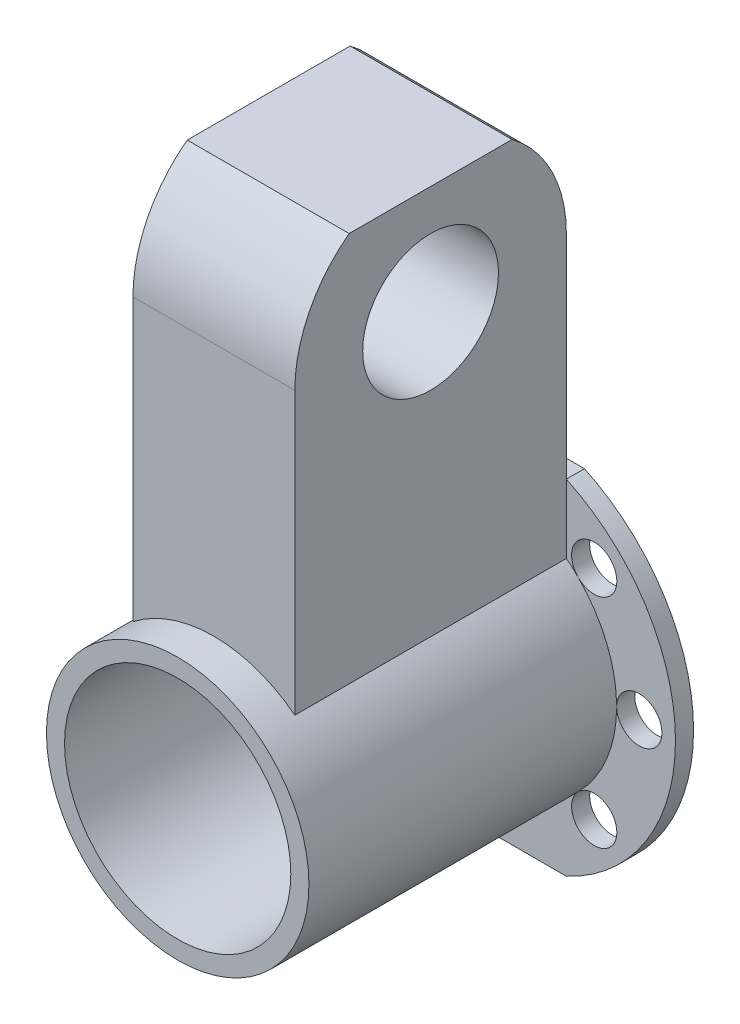
ISO-10303-21;
HEADER;
FILE_DESCRIPTION(('STEP AP214'),'2;1');
FILE_NAME('part.step','',(''),(''),'','','');
FILE_SCHEMA(('AUTOMOTIVE_DESIGN { 1 0 10303 214 1 1 1 1 }'));
ENDSEC;
DATA;
#1=APPLICATION_CONTEXT('core data for automotive mechanical design processes');
#2=APPLICATION_PROTOCOL_DEFINITION('international standard','automotive_design',2000,#1);
#3=PRODUCT_CONTEXT('',#1,'mechanical');
#4=PRODUCT('Part','Part','',(#3));
#5=PRODUCT_RELATED_PRODUCT_CATEGORY('part','',(#4));
#6=PRODUCT_DEFINITION_FORMATION('','',#4);
#7=PRODUCT_DEFINITION_CONTEXT('part definition',#1,'design');
#8=PRODUCT_DEFINITION('design','',#6,#7);
#9=PRODUCT_DEFINITION_SHAPE('','',#8);
#10=(LENGTH_UNIT() NAMED_UNIT(*) SI_UNIT(.MILLI.,.METRE.));
#11=(NAMED_UNIT(*) PLANE_ANGLE_UNIT() SI_UNIT($,.RADIAN.));
#12=(NAMED_UNIT(*) SI_UNIT($,.STERADIAN.) SOLID_ANGLE_UNIT());
#13=UNCERTAINTY_MEASURE_WITH_UNIT(LENGTH_MEASURE(1.E-05),#10,'distance_accuracy_value','');
#14=(GEOMETRIC_REPRESENTATION_CONTEXT(3) GLOBAL_UNCERTAINTY_ASSIGNED_CONTEXT((#13)) GLOBAL_UNIT_ASSIGNED_CONTEXT((#10,
#11,#12)) REPRESENTATION_CONTEXT('',''));
#15=CARTESIAN_POINT('',(0.,0.,0.));
#16=DIRECTION('',(0.,0.,1.));
#17=DIRECTION('',(1.,0.,0.));
#18=AXIS2_PLACEMENT_3D('',#15,#16,#17);
#19=CARTESIAN_POINT('',(-8.94427190999916,-19.0010000000001,0.));
#20=DIRECTION('',(-1.,0.,0.));
#21=DIRECTION('',(0.,-1.,0.));
#22=AXIS2_PLACEMENT_3D('',#19,#20,#21);
#23=PLANE('',#22);
#24=CARTESIAN_POINT('',(-8.94427190999873,42.5000000000001,15.));
#25=DIRECTION('',(-1.,0.,0.));
#26=DIRECTION('',(0.,-1.,0.));
#27=AXIS2_PLACEMENT_3D('',#24,#25,#26);
#28=CIRCLE('',#27,7.5);
#29=CARTESIAN_POINT('',(-8.94427190999879,35.0000000000001,15.));
#30=VERTEX_POINT('',#29);
#31=EDGE_CURVE('E255',#30,#30,#28,.T.);
#32=ORIENTED_EDGE('',*,*,#31,.F.);
#33=EDGE_LOOP('',(#32));
#34=FACE_BOUND('',#33,.T.);
#35=CARTESIAN_POINT('',(-8.94427190999873,42.5000000000001,15.));
#36=DIRECTION('',(1.,0.,0.));
#37=DIRECTION('',(0.,-1.,0.));
#38=AXIS2_PLACEMENT_3D('',#35,#36,#37);
#39=CIRCLE('',#38,15.);
#40=CARTESIAN_POINT('',(-8.94427190999873,42.5000000000001,0.));
#41=VERTEX_POINT('',#40);
#42=CARTESIAN_POINT('',(-8.94427190999865,54.5000000000001,6.00000000000002));
#43=VERTEX_POINT('',#42);
#44=EDGE_CURVE('E57',#41,#43,#39,.T.);
#45=ORIENTED_EDGE('',*,*,#44,.F.);
#46=DIRECTION('',(0.,-1.,0.));
#47=VECTOR('',#46,1.);
#48=CARTESIAN_POINT('',(-8.94427190999865,54.5000000000001,0.));
#49=LINE('',#48,#47);
#50=CARTESIAN_POINT('',(-8.94427190999916,19.,0.));
#51=VERTEX_POINT('',#50);
#52=EDGE_CURVE('E138',#41,#51,#49,.T.);
#53=ORIENTED_EDGE('',*,*,#52,.T.);
#54=DIRECTION('',(0.,1.,0.));
#55=VECTOR('',#54,1.);
#56=CARTESIAN_POINT('',(-8.94427190999916,-19.0010000000001,0.));
#57=LINE('',#56,#55);
#58=CARTESIAN_POINT('',(-8.94427190999895,11.4127122105135,0.));
#59=VERTEX_POINT('',#58);
#60=EDGE_CURVE('E239',#59,#51,#57,.T.);
#61=ORIENTED_EDGE('',*,*,#60,.F.);
#62=DIRECTION('',(0.,0.,-1.));
#63=VECTOR('',#62,1.);
#64=CARTESIAN_POINT('',(-8.94427190999895,11.4127122105135,34.));
#65=LINE('',#64,#63);
#66=CARTESIAN_POINT('',(-8.94427190999895,11.4127122105135,30.));
#67=VERTEX_POINT('',#66);
#68=EDGE_CURVE('E236',#59,#67,#65,.F.);
#69=ORIENTED_EDGE('',*,*,#68,.T.);
#70=DIRECTION('',(0.,1.,0.));
#71=VECTOR('',#70,1.);
#72=CARTESIAN_POINT('',(-8.94427190999916,-19.0010000000001,30.));
#73=LINE('',#72,#71);
#74=CARTESIAN_POINT('',(-8.94427190999873,42.5000000000001,30.));
#75=VERTEX_POINT('',#74);
#76=EDGE_CURVE('E232',#67,#75,#73,.T.);
#77=ORIENTED_EDGE('',*,*,#76,.T.);
#78=CARTESIAN_POINT('',(-8.94427190999873,42.5000000000001,15.));
#79=DIRECTION('',(1.,0.,0.));
#80=DIRECTION('',(0.,-1.,0.));
#81=AXIS2_PLACEMENT_3D('',#78,#79,#80);
#82=CIRCLE('',#81,15.);
#83=CARTESIAN_POINT('',(-8.94427190999865,54.5000000000001,24.));
#84=VERTEX_POINT('',#83);
#85=EDGE_CURVE('E257',#84,#75,#82,.T.);
#86=ORIENTED_EDGE('',*,*,#85,.F.);
#87=DIRECTION('',(0.,0.,1.));
#88=VECTOR('',#87,1.);
#89=CARTESIAN_POINT('',(-8.94427190999865,54.5000000000001,0.));
#90=LINE('',#89,#88);
#91=EDGE_CURVE('E142',#43,#84,#90,.T.);
#92=ORIENTED_EDGE('',*,*,#91,.F.);
#93=EDGE_LOOP('',(#45,#53,#61,#69,#77,#86,#92));
#94=FACE_BOUND('',#93,.T.);
#95=ADVANCED_FACE('F35',(#34,#94),#23,.T.);
#96=CARTESIAN_POINT('',(8.9442719099989,-19.0010000000002,0.));
#97=DIRECTION('',(1.,0.,0.));
#98=DIRECTION('',(0.,1.,0.));
#99=AXIS2_PLACEMENT_3D('',#96,#97,#98);
#100=PLANE('',#99);
#101=CARTESIAN_POINT('',(8.94427190999933,42.4999999999999,15.));
#102=DIRECTION('',(1.,0.,0.));
#103=DIRECTION('',(0.,1.,0.));
#104=AXIS2_PLACEMENT_3D('',#101,#102,#103);
#105=CIRCLE('',#104,7.5);
#106=CARTESIAN_POINT('',(8.94427190999938,49.9999999999999,15.));
#107=VERTEX_POINT('',#106);
#108=EDGE_CURVE('E253',#107,#107,#105,.T.);
#109=ORIENTED_EDGE('',*,*,#108,.F.);
#110=EDGE_LOOP('',(#109));
#111=FACE_BOUND('',#110,.T.);
#112=CARTESIAN_POINT('',(8.94427190999933,42.4999999999999,15.));
#113=DIRECTION('',(1.,0.,0.));
#114=DIRECTION('',(0.,1.,0.));
#115=AXIS2_PLACEMENT_3D('',#112,#113,#114);
#116=CIRCLE('',#115,15.);
#117=CARTESIAN_POINT('',(8.94427190999941,54.4999999999999,6.00000000000002));
#118=VERTEX_POINT('',#117);
#119=CARTESIAN_POINT('',(8.94427190999929,42.4999999999999,0.));
#120=VERTEX_POINT('',#119);
#121=EDGE_CURVE('E130',#118,#120,#116,.F.);
#122=ORIENTED_EDGE('',*,*,#121,.F.);
#123=DIRECTION('',(0.,0.,-1.));
#124=VECTOR('',#123,1.);
#125=CARTESIAN_POINT('',(8.94427190999941,54.4999999999999,30.));
#126=LINE('',#125,#124);
#127=CARTESIAN_POINT('',(8.94427190999941,54.4999999999999,24.));
#128=VERTEX_POINT('',#127);
#129=EDGE_CURVE('E150',#128,#118,#126,.T.);
#130=ORIENTED_EDGE('',*,*,#129,.F.);
#131=CARTESIAN_POINT('',(8.94427190999933,42.4999999999999,15.));
#132=DIRECTION('',(1.,0.,0.));
#133=DIRECTION('',(0.,1.,0.));
#134=AXIS2_PLACEMENT_3D('',#131,#132,#133);
#135=CIRCLE('',#134,15.);
#136=CARTESIAN_POINT('',(8.94427190999943,42.4999999999999,30.));
#137=VERTEX_POINT('',#136);
#138=EDGE_CURVE('E50',#137,#128,#135,.F.);
#139=ORIENTED_EDGE('',*,*,#138,.F.);
#140=DIRECTION('',(0.,1.,0.));
#141=VECTOR('',#140,1.);
#142=CARTESIAN_POINT('',(8.9442719099989,-19.0010000000002,30.));
#143=LINE('',#142,#141);
#144=CARTESIAN_POINT('',(8.94427190999911,11.4127122105134,30.));
#145=VERTEX_POINT('',#144);
#146=EDGE_CURVE('E152',#145,#137,#143,.T.);
#147=ORIENTED_EDGE('',*,*,#146,.F.);
#148=DIRECTION('',(0.,0.,-1.));
#149=VECTOR('',#148,1.);
#150=CARTESIAN_POINT('',(8.94427190999911,11.4127122105134,34.));
#151=LINE('',#150,#149);
#152=CARTESIAN_POINT('',(8.94427190999911,11.4127122105134,0.));
#153=VERTEX_POINT('',#152);
#154=EDGE_CURVE('E162',#145,#153,#151,.T.);
#155=ORIENTED_EDGE('',*,*,#154,.T.);
#156=DIRECTION('',(0.,1.,0.));
#157=VECTOR('',#156,1.);
#158=CARTESIAN_POINT('',(8.9442719099989,-19.0010000000002,0.));
#159=LINE('',#158,#157);
#160=CARTESIAN_POINT('',(8.94427190999916,19.,0.));
#161=VERTEX_POINT('',#160);
#162=EDGE_CURVE('E158',#153,#161,#159,.T.);
#163=ORIENTED_EDGE('',*,*,#162,.T.);
#164=DIRECTION('',(0.,-1.,0.));
#165=VECTOR('',#164,1.);
#166=CARTESIAN_POINT('',(8.94427190999941,54.4999999999999,0.));
#167=LINE('',#166,#165);
#168=EDGE_CURVE('E149',#120,#161,#167,.T.);
#169=ORIENTED_EDGE('',*,*,#168,.F.);
#170=EDGE_LOOP('',(#122,#130,#139,#147,#155,#163,#169));
#171=FACE_BOUND('',#170,.T.);
#172=ADVANCED_FACE('F272',(#111,#171),#100,.T.);
#173=CARTESIAN_POINT('',(0.,0.,0.));
#174=DIRECTION('',(0.,0.,-1.));
#175=DIRECTION('',(-1.,0.,0.));
#176=AXIS2_PLACEMENT_3D('',#173,#174,#175);
#177=PLANE('',#176);
#178=ORIENTED_EDGE('',*,*,#60,.T.);
#179=CARTESIAN_POINT('',(0.,0.,0.));
#180=DIRECTION('',(0.,0.,-1.));
#181=DIRECTION('',(-1.,0.,0.));
#182=AXIS2_PLACEMENT_3D('',#179,#180,#181);
#183=CIRCLE('',#182,21.);
#184=CARTESIAN_POINT('',(-8.94427190999916,-19.,0.));
#185=VERTEX_POINT('',#184);
#186=EDGE_CURVE('E195',#185,#51,#183,.T.);
#187=ORIENTED_EDGE('',*,*,#186,.F.);
#188=DIRECTION('',(1.,0.,0.));
#189=VECTOR('',#188,1.);
#190=CARTESIAN_POINT('',(0.,-19.,0.));
#191=LINE('',#190,#189);
#192=CARTESIAN_POINT('',(8.94427190999916,-19.,0.));
#193=VERTEX_POINT('',#192);
#194=EDGE_CURVE('E170',#185,#193,#191,.T.);
#195=ORIENTED_EDGE('',*,*,#194,.T.);
#196=EDGE_CURVE('E201',#161,#193,#183,.T.);
#197=ORIENTED_EDGE('',*,*,#196,.F.);
#198=ORIENTED_EDGE('',*,*,#162,.F.);
#199=CARTESIAN_POINT('',(0.,0.,0.));
#200=DIRECTION('',(0.,0.,1.));
#201=DIRECTION('',(1.,0.,0.));
#202=AXIS2_PLACEMENT_3D('',#199,#200,#201);
#203=CIRCLE('',#202,14.5);
#204=CARTESIAN_POINT('',(10.2530483272049,10.253048327205,0.));
#205=VERTEX_POINT('',#204);
#206=EDGE_CURVE('E245',#205,#153,#203,.T.);
#207=ORIENTED_EDGE('',*,*,#206,.F.);
#208=CARTESIAN_POINT('',(12.0208152801713,12.0208152801713,0.));
#209=DIRECTION('',(0.,0.,-1.));
#210=DIRECTION('',(-1.,0.,0.));
#211=AXIS2_PLACEMENT_3D('',#208,#209,#210);
#212=CIRCLE('',#211,2.5);
#213=EDGE_CURVE('E196',#205,#205,#212,.T.);
#214=ORIENTED_EDGE('',*,*,#213,.T.);
#215=CARTESIAN_POINT('',(14.5,0.,0.));
#216=VERTEX_POINT('',#215);
#217=EDGE_CURVE('E531',#216,#205,#203,.T.);
#218=ORIENTED_EDGE('',*,*,#217,.F.);
#219=CARTESIAN_POINT('',(17.,0.,0.));
#220=DIRECTION('',(0.,0.,-1.));
#221=DIRECTION('',(-1.,0.,0.));
#222=AXIS2_PLACEMENT_3D('',#219,#220,#221);
#223=CIRCLE('',#222,2.5);
#224=EDGE_CURVE('E191',#216,#216,#223,.T.);
#225=ORIENTED_EDGE('',*,*,#224,.T.);
#226=CARTESIAN_POINT('',(10.2530483272051,-10.2530483272048,0.));
#227=VERTEX_POINT('',#226);
#228=EDGE_CURVE('E532',#227,#216,#203,.T.);
#229=ORIENTED_EDGE('',*,*,#228,.F.);
#230=CARTESIAN_POINT('',(12.0208152801715,-12.0208152801712,0.));
#231=DIRECTION('',(0.,0.,-1.));
#232=DIRECTION('',(-1.,0.,0.));
#233=AXIS2_PLACEMENT_3D('',#230,#231,#232);
#234=CIRCLE('',#233,2.5);
#235=EDGE_CURVE('E206',#227,#227,#234,.T.);
#236=ORIENTED_EDGE('',*,*,#235,.T.);
#237=CARTESIAN_POINT('',(-10.2530483272049,-10.253048327205,0.));
#238=VERTEX_POINT('',#237);
#239=EDGE_CURVE('E533',#238,#227,#203,.T.);
#240=ORIENTED_EDGE('',*,*,#239,.F.);
#241=CARTESIAN_POINT('',(-12.0208152801712,-12.0208152801714,0.));
#242=DIRECTION('',(0.,0.,-1.));
#243=DIRECTION('',(-1.,0.,0.));
#244=AXIS2_PLACEMENT_3D('',#241,#242,#243);
#245=CIRCLE('',#244,2.5);
#246=EDGE_CURVE('E209',#238,#238,#245,.T.);
#247=ORIENTED_EDGE('',*,*,#246,.T.);
#248=CARTESIAN_POINT('',(-14.5,-1.01252958826451E-13,0.));
#249=VERTEX_POINT('',#248);
#250=EDGE_CURVE('E535',#249,#238,#203,.T.);
#251=ORIENTED_EDGE('',*,*,#250,.F.);
#252=CARTESIAN_POINT('',(-17.,-1.18710365520667E-13,0.));
#253=DIRECTION('',(0.,0.,-1.));
#254=DIRECTION('',(-1.,0.,0.));
#255=AXIS2_PLACEMENT_3D('',#252,#253,#254);
#256=CIRCLE('',#255,2.5);
#257=EDGE_CURVE('E212',#249,#249,#256,.T.);
#258=ORIENTED_EDGE('',*,*,#257,.T.);
#259=CARTESIAN_POINT('',(-10.253048327205,10.2530483272049,0.));
#260=VERTEX_POINT('',#259);
#261=EDGE_CURVE('E252',#260,#249,#203,.T.);
#262=ORIENTED_EDGE('',*,*,#261,.F.);
#263=CARTESIAN_POINT('',(-12.0208152801714,12.0208152801712,0.));
#264=DIRECTION('',(0.,0.,-1.));
#265=DIRECTION('',(-1.,0.,0.));
#266=AXIS2_PLACEMENT_3D('',#263,#264,#265);
#267=CIRCLE('',#266,2.5);
#268=EDGE_CURVE('E215',#260,#260,#267,.T.);
#269=ORIENTED_EDGE('',*,*,#268,.T.);
#270=EDGE_CURVE('E249',#59,#260,#203,.T.);
#271=ORIENTED_EDGE('',*,*,#270,.F.);
#272=EDGE_LOOP('',(#178,#187,#195,#197,#198,#207,#214,#218,#225,#229,#236,#240,#247,#251,#258,
#262,#269,#271));
#273=FACE_BOUND('',#272,.T.);
#274=ADVANCED_FACE('F287',(#273),#177,.F.);
#275=CARTESIAN_POINT('',(0.,0.,34.));
#276=DIRECTION('',(0.,0.,-1.));
#277=DIRECTION('',(-1.,0.,0.));
#278=AXIS2_PLACEMENT_3D('',#275,#276,#277);
#279=CYLINDRICAL_SURFACE('',#278,14.5);
#280=CARTESIAN_POINT('',(0.,0.,34.));
#281=DIRECTION('',(0.,0.,1.));
#282=DIRECTION('',(1.,0.,0.));
#283=AXIS2_PLACEMENT_3D('',#280,#281,#282);
#284=CIRCLE('',#283,14.5);
#285=CARTESIAN_POINT('',(14.5,0.,34.));
#286=VERTEX_POINT('',#285);
#287=EDGE_CURVE('E246',#286,#286,#284,.T.);
#288=ORIENTED_EDGE('',*,*,#287,.F.);
#289=EDGE_LOOP('',(#288));
#290=FACE_BOUND('',#289,.T.);
#291=ORIENTED_EDGE('',*,*,#154,.F.);
#292=CARTESIAN_POINT('',(0.,0.,30.));
#293=DIRECTION('',(0.,0.,1.));
#294=DIRECTION('',(1.,0.,0.));
#295=AXIS2_PLACEMENT_3D('',#292,#293,#294);
#296=CIRCLE('',#295,14.5);
#297=EDGE_CURVE('E233',#67,#145,#296,.F.);
#298=ORIENTED_EDGE('',*,*,#297,.F.);
#299=ORIENTED_EDGE('',*,*,#68,.F.);
#300=ORIENTED_EDGE('',*,*,#270,.T.);
#301=ORIENTED_EDGE('',*,*,#261,.T.);
#302=ORIENTED_EDGE('',*,*,#250,.T.);
#303=ORIENTED_EDGE('',*,*,#239,.T.);
#304=ORIENTED_EDGE('',*,*,#228,.T.);
#305=ORIENTED_EDGE('',*,*,#217,.T.);
#306=ORIENTED_EDGE('',*,*,#206,.T.);
#307=EDGE_LOOP('',(#291,#298,#299,#300,#301,#302,#303,#304,#305,#306));
#308=FACE_BOUND('',#307,.T.);
#309=ADVANCED_FACE('F37',(#290,#308),#279,.T.);
#310=CARTESIAN_POINT('',(0.,0.,34.));
#311=DIRECTION('',(0.,0.,1.));
#312=DIRECTION('',(1.,0.,0.));
#313=AXIS2_PLACEMENT_3D('',#310,#311,#312);
#314=PLANE('',#313);
#315=ORIENTED_EDGE('',*,*,#287,.T.);
#316=EDGE_LOOP('',(#315));
#317=FACE_BOUND('',#316,.T.);
#318=CARTESIAN_POINT('',(0.,0.,34.));
#319=DIRECTION('',(0.,0.,1.));
#320=DIRECTION('',(1.,0.,0.));
#321=AXIS2_PLACEMENT_3D('',#318,#319,#320);
#322=CIRCLE('',#321,12.5);
#323=CARTESIAN_POINT('',(12.5,0.,34.));
#324=VERTEX_POINT('',#323);
#325=EDGE_CURVE('E235',#324,#324,#322,.T.);
#326=ORIENTED_EDGE('',*,*,#325,.F.);
#327=EDGE_LOOP('',(#326));
#328=FACE_BOUND('',#327,.T.);
#329=ADVANCED_FACE('F316',(#317,#328),#314,.T.);
#330=CARTESIAN_POINT('',(0.,0.,34.));
#331=DIRECTION('',(0.,0.,-1.));
#332=DIRECTION('',(-1.,0.,0.));
#333=AXIS2_PLACEMENT_3D('',#330,#331,#332);
#334=CYLINDRICAL_SURFACE('',#333,12.5);
#335=ORIENTED_EDGE('',*,*,#325,.T.);
#336=EDGE_LOOP('',(#335));
#337=FACE_BOUND('',#336,.T.);
#338=CARTESIAN_POINT('',(0.,0.,-2.));
#339=DIRECTION('',(0.,0.,-1.));
#340=DIRECTION('',(-1.,0.,0.));
#341=AXIS2_PLACEMENT_3D('',#338,#339,#340);
#342=CIRCLE('',#341,12.5);
#343=CARTESIAN_POINT('',(-12.5,0.,-2.));
#344=VERTEX_POINT('',#343);
#345=EDGE_CURVE('E192',#344,#344,#342,.T.);
#346=ORIENTED_EDGE('',*,*,#345,.T.);
#347=EDGE_LOOP('',(#346));
#348=FACE_BOUND('',#347,.T.);
#349=ADVANCED_FACE('F314',(#337,#348),#334,.F.);
#350=CARTESIAN_POINT('',(-8.94427190999916,-19.0010000000001,30.));
#351=DIRECTION('',(0.,0.,1.));
#352=DIRECTION('',(1.,0.,0.));
#353=AXIS2_PLACEMENT_3D('',#350,#351,#352);
#354=PLANE('',#353);
#355=DIRECTION('',(-1.,0.,0.));
#356=VECTOR('',#355,1.);
#357=CARTESIAN_POINT('',(84.0557280900013,42.4999999999994,30.));
#358=LINE('',#357,#356);
#359=EDGE_CURVE('E143',#137,#75,#358,.T.);
#360=ORIENTED_EDGE('',*,*,#359,.T.);
#361=ORIENTED_EDGE('',*,*,#76,.F.);
#362=ORIENTED_EDGE('',*,*,#297,.T.);
#363=ORIENTED_EDGE('',*,*,#146,.T.);
#364=EDGE_LOOP('',(#360,#361,#362,#363));
#365=FACE_BOUND('',#364,.T.);
#366=ADVANCED_FACE('F269',(#365),#354,.T.);
#367=CARTESIAN_POINT('',(0.,0.,-2.));
#368=DIRECTION('',(0.,0.,1.));
#369=DIRECTION('',(1.,0.,0.));
#370=AXIS2_PLACEMENT_3D('',#367,#368,#369);
#371=CYLINDRICAL_SURFACE('',#370,21.);
#372=CARTESIAN_POINT('',(0.,0.,-2.));
#373=DIRECTION('',(0.,0.,-1.));
#374=DIRECTION('',(-1.,0.,0.));
#375=AXIS2_PLACEMENT_3D('',#372,#373,#374);
#376=CIRCLE('',#375,21.);
#377=CARTESIAN_POINT('',(-8.94427190999916,-19.,-2.));
#378=VERTEX_POINT('',#377);
#379=CARTESIAN_POINT('',(-8.94427190999916,19.,-2.));
#380=VERTEX_POINT('',#379);
#381=EDGE_CURVE('E197',#378,#380,#376,.T.);
#382=ORIENTED_EDGE('',*,*,#381,.F.);
#383=DIRECTION('',(0.,0.,1.));
#384=VECTOR('',#383,1.);
#385=CARTESIAN_POINT('',(-8.94427190999916,-19.,-2.));
#386=LINE('',#385,#384);
#387=EDGE_CURVE('E229',#378,#185,#386,.T.);
#388=ORIENTED_EDGE('',*,*,#387,.T.);
#389=ORIENTED_EDGE('',*,*,#186,.T.);
#390=DIRECTION('',(0.,0.,1.));
#391=VECTOR('',#390,1.);
#392=CARTESIAN_POINT('',(-8.94427190999916,19.,-2.));
#393=LINE('',#392,#391);
#394=EDGE_CURVE('E220',#51,#380,#393,.F.);
#395=ORIENTED_EDGE('',*,*,#394,.T.);
#396=EDGE_LOOP('',(#382,#388,#389,#395));
#397=FACE_BOUND('',#396,.T.);
#398=ADVANCED_FACE('F294',(#397),#371,.T.);
#399=CARTESIAN_POINT('',(0.,0.,-2.));
#400=DIRECTION('',(0.,0.,-1.));
#401=DIRECTION('',(-1.,0.,0.));
#402=AXIS2_PLACEMENT_3D('',#399,#400,#401);
#403=PLANE('',#402);
#404=DIRECTION('',(1.,0.,0.));
#405=VECTOR('',#404,1.);
#406=CARTESIAN_POINT('',(8.94427190999916,-19.,-2.));
#407=LINE('',#406,#405);
#408=CARTESIAN_POINT('',(8.94427190999916,-19.,-2.));
#409=VERTEX_POINT('',#408);
#410=EDGE_CURVE('E166',#378,#409,#407,.T.);
#411=ORIENTED_EDGE('',*,*,#410,.F.);
#412=ORIENTED_EDGE('',*,*,#381,.T.);
#413=DIRECTION('',(-1.,0.,0.));
#414=VECTOR('',#413,1.);
#415=CARTESIAN_POINT('',(8.94427190999916,19.,-2.));
#416=LINE('',#415,#414);
#417=CARTESIAN_POINT('',(8.94427190999916,19.,-2.));
#418=VERTEX_POINT('',#417);
#419=EDGE_CURVE('E161',#418,#380,#416,.T.);
#420=ORIENTED_EDGE('',*,*,#419,.F.);
#421=EDGE_CURVE('E200',#418,#409,#376,.T.);
#422=ORIENTED_EDGE('',*,*,#421,.T.);
#423=EDGE_LOOP('',(#411,#412,#420,#422));
#424=FACE_BOUND('',#423,.T.);
#425=CARTESIAN_POINT('',(12.0208152801713,12.0208152801713,-2.));
#426=DIRECTION('',(0.,0.,-1.));
#427=DIRECTION('',(-1.,0.,0.));
#428=AXIS2_PLACEMENT_3D('',#425,#426,#427);
#429=CIRCLE('',#428,2.5);
#430=CARTESIAN_POINT('',(9.52081528017129,12.0208152801713,-2.));
#431=VERTEX_POINT('',#430);
#432=EDGE_CURVE('E177',#431,#431,#429,.T.);
#433=ORIENTED_EDGE('',*,*,#432,.F.);
#434=EDGE_LOOP('',(#433));
#435=FACE_BOUND('',#434,.T.);
#436=CARTESIAN_POINT('',(-12.0208152801714,12.0208152801712,-2.));
#437=DIRECTION('',(0.,0.,-1.));
#438=DIRECTION('',(-1.,0.,0.));
#439=AXIS2_PLACEMENT_3D('',#436,#437,#438);
#440=CIRCLE('',#439,2.5);
#441=CARTESIAN_POINT('',(-14.5208152801714,12.0208152801712,-2.));
#442=VERTEX_POINT('',#441);
#443=EDGE_CURVE('E181',#442,#442,#440,.T.);
#444=ORIENTED_EDGE('',*,*,#443,.F.);
#445=EDGE_LOOP('',(#444));
#446=FACE_BOUND('',#445,.T.);
#447=CARTESIAN_POINT('',(-17.,-1.18710365520667E-13,-2.));
#448=DIRECTION('',(0.,0.,-1.));
#449=DIRECTION('',(-1.,0.,0.));
#450=AXIS2_PLACEMENT_3D('',#447,#448,#449);
#451=CIRCLE('',#450,2.5);
#452=CARTESIAN_POINT('',(-19.5,-1.18710365520667E-13,-2.));
#453=VERTEX_POINT('',#452);
#454=EDGE_CURVE('E184',#453,#453,#451,.T.);
#455=ORIENTED_EDGE('',*,*,#454,.F.);
#456=EDGE_LOOP('',(#455));
#457=FACE_BOUND('',#456,.T.);
#458=CARTESIAN_POINT('',(-12.0208152801712,-12.0208152801714,-2.));
#459=DIRECTION('',(0.,0.,-1.));
#460=DIRECTION('',(-1.,0.,0.));
#461=AXIS2_PLACEMENT_3D('',#458,#459,#460);
#462=CIRCLE('',#461,2.5);
#463=CARTESIAN_POINT('',(-14.5208152801712,-12.0208152801714,-2.));
#464=VERTEX_POINT('',#463);
#465=EDGE_CURVE('E176',#464,#464,#462,.T.);
#466=ORIENTED_EDGE('',*,*,#465,.F.);
#467=EDGE_LOOP('',(#466));
#468=FACE_BOUND('',#467,.T.);
#469=CARTESIAN_POINT('',(12.0208152801715,-12.0208152801712,-2.));
#470=DIRECTION('',(0.,0.,-1.));
#471=DIRECTION('',(-1.,0.,0.));
#472=AXIS2_PLACEMENT_3D('',#469,#470,#471);
#473=CIRCLE('',#472,2.5);
#474=CARTESIAN_POINT('',(9.52081528017145,-12.0208152801712,-2.));
#475=VERTEX_POINT('',#474);
#476=EDGE_CURVE('E173',#475,#475,#473,.T.);
#477=ORIENTED_EDGE('',*,*,#476,.F.);
#478=EDGE_LOOP('',(#477));
#479=FACE_BOUND('',#478,.T.);
#480=CARTESIAN_POINT('',(17.,0.,-2.));
#481=DIRECTION('',(0.,0.,-1.));
#482=DIRECTION('',(-1.,0.,0.));
#483=AXIS2_PLACEMENT_3D('',#480,#481,#482);
#484=CIRCLE('',#483,2.5);
#485=CARTESIAN_POINT('',(14.5,0.,-2.));
#486=VERTEX_POINT('',#485);
#487=EDGE_CURVE('E180',#486,#486,#484,.T.);
#488=ORIENTED_EDGE('',*,*,#487,.F.);
#489=EDGE_LOOP('',(#488));
#490=FACE_BOUND('',#489,.T.);
#491=ORIENTED_EDGE('',*,*,#345,.F.);
#492=EDGE_LOOP('',(#491));
#493=FACE_BOUND('',#492,.T.);
#494=ADVANCED_FACE('F296',(#424,#435,#446,#457,#468,#479,#490,#493),#403,.T.);
#495=ORIENTED_EDGE('',*,*,#196,.T.);
#496=DIRECTION('',(0.,0.,1.));
#497=VECTOR('',#496,1.);
#498=CARTESIAN_POINT('',(8.94427190999916,-19.,-2.));
#499=LINE('',#498,#497);
#500=EDGE_CURVE('E226',#193,#409,#499,.F.);
#501=ORIENTED_EDGE('',*,*,#500,.T.);
#502=ORIENTED_EDGE('',*,*,#421,.F.);
#503=DIRECTION('',(0.,0.,1.));
#504=VECTOR('',#503,1.);
#505=CARTESIAN_POINT('',(8.94427190999916,19.,-2.));
#506=LINE('',#505,#504);
#507=EDGE_CURVE('E223',#418,#161,#506,.T.);
#508=ORIENTED_EDGE('',*,*,#507,.T.);
#509=EDGE_LOOP('',(#495,#501,#502,#508));
#510=FACE_BOUND('',#509,.T.);
#511=ADVANCED_FACE('F285',(#510),#371,.T.);
#512=CARTESIAN_POINT('',(17.,0.,76.));
#513=DIRECTION('',(0.,0.,-1.));
#514=DIRECTION('',(-1.,0.,0.));
#515=AXIS2_PLACEMENT_3D('',#512,#513,#514);
#516=CYLINDRICAL_SURFACE('',#515,2.5);
#517=ORIENTED_EDGE('',*,*,#487,.T.);
#518=EDGE_LOOP('',(#517));
#519=FACE_BOUND('',#518,.T.);
#520=ORIENTED_EDGE('',*,*,#224,.F.);
#521=EDGE_LOOP('',(#520));
#522=FACE_BOUND('',#521,.T.);
#523=ADVANCED_FACE('F337',(#519,#522),#516,.F.);
#524=CARTESIAN_POINT('',(12.0208152801715,-12.0208152801712,76.));
#525=DIRECTION('',(0.,0.,-1.));
#526=DIRECTION('',(-1.,0.,0.));
#527=AXIS2_PLACEMENT_3D('',#524,#525,#526);
#528=CYLINDRICAL_SURFACE('',#527,2.5);
#529=ORIENTED_EDGE('',*,*,#476,.T.);
#530=EDGE_LOOP('',(#529));
#531=FACE_BOUND('',#530,.T.);
#532=ORIENTED_EDGE('',*,*,#235,.F.);
#533=EDGE_LOOP('',(#532));
#534=FACE_BOUND('',#533,.T.);
#535=ADVANCED_FACE('F342',(#531,#534),#528,.F.);
#536=CARTESIAN_POINT('',(-12.0208152801712,-12.0208152801714,76.));
#537=DIRECTION('',(0.,0.,-1.));
#538=DIRECTION('',(-1.,0.,0.));
#539=AXIS2_PLACEMENT_3D('',#536,#537,#538);
#540=CYLINDRICAL_SURFACE('',#539,2.5);
#541=ORIENTED_EDGE('',*,*,#465,.T.);
#542=EDGE_LOOP('',(#541));
#543=FACE_BOUND('',#542,.T.);
#544=ORIENTED_EDGE('',*,*,#246,.F.);
#545=EDGE_LOOP('',(#544));
#546=FACE_BOUND('',#545,.T.);
#547=ADVANCED_FACE('F344',(#543,#546),#540,.F.);
#548=CARTESIAN_POINT('',(-17.,-1.18710365520667E-13,76.));
#549=DIRECTION('',(0.,0.,-1.));
#550=DIRECTION('',(-1.,0.,0.));
#551=AXIS2_PLACEMENT_3D('',#548,#549,#550);
#552=CYLINDRICAL_SURFACE('',#551,2.5);
#553=ORIENTED_EDGE('',*,*,#454,.T.);
#554=EDGE_LOOP('',(#553));
#555=FACE_BOUND('',#554,.T.);
#556=ORIENTED_EDGE('',*,*,#257,.F.);
#557=EDGE_LOOP('',(#556));
#558=FACE_BOUND('',#557,.T.);
#559=ADVANCED_FACE('F347',(#555,#558),#552,.F.);
#560=CARTESIAN_POINT('',(-12.0208152801714,12.0208152801712,76.));
#561=DIRECTION('',(0.,0.,-1.));
#562=DIRECTION('',(-1.,0.,0.));
#563=AXIS2_PLACEMENT_3D('',#560,#561,#562);
#564=CYLINDRICAL_SURFACE('',#563,2.5);
#565=ORIENTED_EDGE('',*,*,#443,.T.);
#566=EDGE_LOOP('',(#565));
#567=FACE_BOUND('',#566,.T.);
#568=ORIENTED_EDGE('',*,*,#268,.F.);
#569=EDGE_LOOP('',(#568));
#570=FACE_BOUND('',#569,.T.);
#571=ADVANCED_FACE('F351',(#567,#570),#564,.F.);
#572=CARTESIAN_POINT('',(12.0208152801713,12.0208152801713,76.));
#573=DIRECTION('',(0.,0.,-1.));
#574=DIRECTION('',(-1.,0.,0.));
#575=AXIS2_PLACEMENT_3D('',#572,#573,#574);
#576=CYLINDRICAL_SURFACE('',#575,2.5);
#577=ORIENTED_EDGE('',*,*,#432,.T.);
#578=EDGE_LOOP('',(#577));
#579=FACE_BOUND('',#578,.T.);
#580=ORIENTED_EDGE('',*,*,#213,.F.);
#581=EDGE_LOOP('',(#580));
#582=FACE_BOUND('',#581,.T.);
#583=ADVANCED_FACE('F355',(#579,#582),#576,.F.);
#584=CARTESIAN_POINT('',(8.94427190999916,19.,76.));
#585=DIRECTION('',(0.,-1.,0.));
#586=DIRECTION('',(0.,0.,-1.));
#587=AXIS2_PLACEMENT_3D('',#584,#585,#586);
#588=PLANE('',#587);
#589=ORIENTED_EDGE('',*,*,#507,.F.);
#590=ORIENTED_EDGE('',*,*,#419,.T.);
#591=ORIENTED_EDGE('',*,*,#394,.F.);
#592=DIRECTION('',(-1.,0.,0.));
#593=VECTOR('',#592,1.);
#594=CARTESIAN_POINT('',(0.,19.,0.));
#595=LINE('',#594,#593);
#596=EDGE_CURVE('E148',#161,#51,#595,.T.);
#597=ORIENTED_EDGE('',*,*,#596,.F.);
#598=EDGE_LOOP('',(#589,#590,#591,#597));
#599=FACE_BOUND('',#598,.T.);
#600=ADVANCED_FACE('F280',(#599),#588,.F.);
#601=CARTESIAN_POINT('',(8.94427190999916,-19.,76.));
#602=DIRECTION('',(0.,1.,0.));
#603=DIRECTION('',(0.,0.,1.));
#604=AXIS2_PLACEMENT_3D('',#601,#602,#603);
#605=PLANE('',#604);
#606=ORIENTED_EDGE('',*,*,#387,.F.);
#607=ORIENTED_EDGE('',*,*,#410,.T.);
#608=ORIENTED_EDGE('',*,*,#500,.F.);
#609=ORIENTED_EDGE('',*,*,#194,.F.);
#610=EDGE_LOOP('',(#606,#607,#608,#609));
#611=FACE_BOUND('',#610,.T.);
#612=ADVANCED_FACE('F290',(#611),#605,.F.);
#613=CARTESIAN_POINT('',(8.94427190999941,54.4999999999999,0.));
#614=DIRECTION('',(0.,0.,1.));
#615=DIRECTION('',(1.,0.,0.));
#616=AXIS2_PLACEMENT_3D('',#613,#614,#615);
#617=PLANE('',#616);
#618=ORIENTED_EDGE('',*,*,#52,.F.);
#619=DIRECTION('',(-1.,0.,0.));
#620=VECTOR('',#619,1.);
#621=CARTESIAN_POINT('',(84.0557280900013,42.4999999999994,0.));
#622=LINE('',#621,#620);
#623=EDGE_CURVE('E127',#120,#41,#622,.T.);
#624=ORIENTED_EDGE('',*,*,#623,.F.);
#625=ORIENTED_EDGE('',*,*,#168,.T.);
#626=ORIENTED_EDGE('',*,*,#596,.T.);
#627=EDGE_LOOP('',(#618,#624,#625,#626));
#628=FACE_BOUND('',#627,.T.);
#629=ADVANCED_FACE('F146',(#628),#617,.F.);
#630=CARTESIAN_POINT('',(3.80525938177439E-13,54.5,0.));
#631=DIRECTION('',(0.,1.,0.));
#632=DIRECTION('',(-1.,0.,0.));
#633=AXIS2_PLACEMENT_3D('',#630,#631,#632);
#634=PLANE('',#633);
#635=DIRECTION('',(-1.,0.,0.));
#636=VECTOR('',#635,1.);
#637=CARTESIAN_POINT('',(84.0557280900014,54.4999999999994,6.00000000000001));
#638=LINE('',#637,#636);
#639=EDGE_CURVE('E11',#43,#118,#638,.F.);
#640=ORIENTED_EDGE('',*,*,#639,.F.);
#641=ORIENTED_EDGE('',*,*,#91,.T.);
#642=DIRECTION('',(-1.,0.,0.));
#643=VECTOR('',#642,1.);
#644=CARTESIAN_POINT('',(84.0557280900014,54.4999999999994,24.));
#645=LINE('',#644,#643);
#646=EDGE_CURVE('E43',#128,#84,#645,.T.);
#647=ORIENTED_EDGE('',*,*,#646,.F.);
#648=ORIENTED_EDGE('',*,*,#129,.T.);
#649=EDGE_LOOP('',(#640,#641,#647,#648));
#650=FACE_BOUND('',#649,.T.);
#651=ADVANCED_FACE('F262',(#650),#634,.T.);
#652=CARTESIAN_POINT('',(21.0557280900013,42.4999999999999,15.));
#653=DIRECTION('',(-1.,0.,0.));
#654=DIRECTION('',(0.,-1.,0.));
#655=AXIS2_PLACEMENT_3D('',#652,#653,#654);
#656=CYLINDRICAL_SURFACE('',#655,7.5);
#657=ORIENTED_EDGE('',*,*,#108,.T.);
#658=EDGE_LOOP('',(#657));
#659=FACE_BOUND('',#658,.T.);
#660=ORIENTED_EDGE('',*,*,#31,.T.);
#661=EDGE_LOOP('',(#660));
#662=FACE_BOUND('',#661,.T.);
#663=ADVANCED_FACE('F371',(#659,#662),#656,.F.);
#664=CARTESIAN_POINT('',(84.0557280900013,42.4999999999994,15.));
#665=DIRECTION('',(-1.,0.,0.));
#666=DIRECTION('',(0.,-1.,0.));
#667=AXIS2_PLACEMENT_3D('',#664,#665,#666);
#668=CYLINDRICAL_SURFACE('',#667,15.);
#669=ORIENTED_EDGE('',*,*,#138,.T.);
#670=ORIENTED_EDGE('',*,*,#646,.T.);
#671=ORIENTED_EDGE('',*,*,#85,.T.);
#672=ORIENTED_EDGE('',*,*,#359,.F.);
#673=EDGE_LOOP('',(#669,#670,#671,#672));
#674=FACE_BOUND('',#673,.T.);
#675=ADVANCED_FACE('F256',(#674),#668,.T.);
#676=CARTESIAN_POINT('',(84.0557280900013,42.4999999999994,15.));
#677=DIRECTION('',(-1.,0.,0.));
#678=DIRECTION('',(0.,-1.,0.));
#679=AXIS2_PLACEMENT_3D('',#676,#677,#678);
#680=CYLINDRICAL_SURFACE('',#679,15.);
#681=ORIENTED_EDGE('',*,*,#121,.T.);
#682=ORIENTED_EDGE('',*,*,#623,.T.);
#683=ORIENTED_EDGE('',*,*,#44,.T.);
#684=ORIENTED_EDGE('',*,*,#639,.T.);
#685=EDGE_LOOP('',(#681,#682,#683,#684));
#686=FACE_BOUND('',#685,.T.);
#687=ADVANCED_FACE('F128',(#686),#680,.T.);
#688=CLOSED_SHELL('',(#95,#172,#274,#309,#329,#349,#366,#398,#494,#511,#523,#535,#547,#559,#571,
#583,#600,#612,#629,#651,#663,#675,#687));
#689=MANIFOLD_SOLID_BREP('B2',#688);
#690=ADVANCED_BREP_SHAPE_REPRESENTATION('',(#18,#689),#14);
#691=SHAPE_DEFINITION_REPRESENTATION(#9,#690);
ENDSEC;
END-ISO-10303-21;
